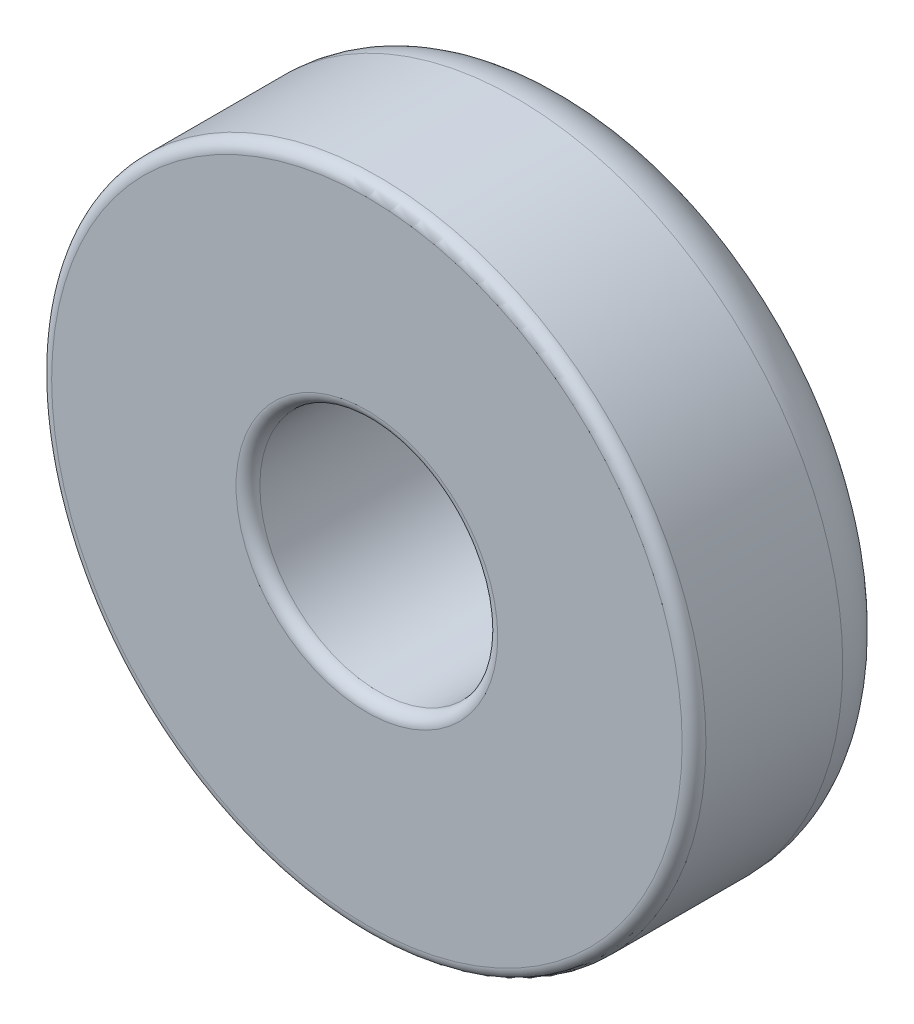
ISO-10303-21;
HEADER;
FILE_DESCRIPTION(('STEP AP214'),'2;1');
FILE_NAME('part.step','',(''),(''),'','','');
FILE_SCHEMA(('AUTOMOTIVE_DESIGN { 1 0 10303 214 1 1 1 1 }'));
ENDSEC;
DATA;
#1=APPLICATION_CONTEXT('core data for automotive mechanical design processes');
#2=APPLICATION_PROTOCOL_DEFINITION('international standard','automotive_design',2000,#1);
#3=PRODUCT_CONTEXT('',#1,'mechanical');
#4=PRODUCT('Part','Part','',(#3));
#5=PRODUCT_RELATED_PRODUCT_CATEGORY('part','',(#4));
#6=PRODUCT_DEFINITION_FORMATION('','',#4);
#7=PRODUCT_DEFINITION_CONTEXT('part definition',#1,'design');
#8=PRODUCT_DEFINITION('design','',#6,#7);
#9=PRODUCT_DEFINITION_SHAPE('','',#8);
#10=(LENGTH_UNIT() NAMED_UNIT(*) SI_UNIT(.MILLI.,.METRE.));
#11=(NAMED_UNIT(*) PLANE_ANGLE_UNIT() SI_UNIT($,.RADIAN.));
#12=(NAMED_UNIT(*) SI_UNIT($,.STERADIAN.) SOLID_ANGLE_UNIT());
#13=UNCERTAINTY_MEASURE_WITH_UNIT(LENGTH_MEASURE(1.E-05),#10,'distance_accuracy_value','');
#14=(GEOMETRIC_REPRESENTATION_CONTEXT(3) GLOBAL_UNCERTAINTY_ASSIGNED_CONTEXT((#13)) GLOBAL_UNIT_ASSIGNED_CONTEXT((#10,
#11,#12)) REPRESENTATION_CONTEXT('',''));
#15=CARTESIAN_POINT('',(0.,0.,0.));
#16=DIRECTION('',(0.,0.,1.));
#17=DIRECTION('',(1.,0.,0.));
#18=AXIS2_PLACEMENT_3D('',#15,#16,#17);
#19=CARTESIAN_POINT('',(0.,0.,1.75));
#20=DIRECTION('',(0.,0.,1.));
#21=DIRECTION('',(1.,0.,0.));
#22=AXIS2_PLACEMENT_3D('',#19,#20,#21);
#23=PLANE('',#22);
#24=CARTESIAN_POINT('',(0.,0.,1.75));
#25=DIRECTION('',(0.,0.,1.));
#26=DIRECTION('',(1.,0.,0.));
#27=AXIS2_PLACEMENT_3D('',#24,#25,#26);
#28=CIRCLE('',#27,1.1);
#29=CARTESIAN_POINT('',(1.1,0.,1.75));
#30=VERTEX_POINT('',#29);
#31=EDGE_CURVE('E52',#30,#30,#28,.F.);
#32=ORIENTED_EDGE('',*,*,#31,.T.);
#33=EDGE_LOOP('',(#32));
#34=FACE_BOUND('',#33,.T.);
#35=CARTESIAN_POINT('',(0.,0.,1.75));
#36=DIRECTION('',(0.,0.,1.));
#37=DIRECTION('',(1.,0.,0.));
#38=AXIS2_PLACEMENT_3D('',#35,#36,#37);
#39=CIRCLE('',#38,2.65);
#40=CARTESIAN_POINT('',(2.65,0.,1.75));
#41=VERTEX_POINT('',#40);
#42=EDGE_CURVE('E56',#41,#41,#39,.T.);
#43=ORIENTED_EDGE('',*,*,#42,.T.);
#44=EDGE_LOOP('',(#43));
#45=FACE_BOUND('',#44,.T.);
#46=ADVANCED_FACE('F45',(#34,#45),#23,.T.);
#47=CARTESIAN_POINT('',(0.,0.,0.));
#48=DIRECTION('',(0.,0.,1.));
#49=DIRECTION('',(1.,0.,0.));
#50=AXIS2_PLACEMENT_3D('',#47,#48,#49);
#51=PLANE('',#50);
#52=CARTESIAN_POINT('',(0.,0.,0.));
#53=DIRECTION('',(0.,0.,1.));
#54=DIRECTION('',(1.,0.,0.));
#55=AXIS2_PLACEMENT_3D('',#52,#53,#54);
#56=CIRCLE('',#55,1.1);
#57=CARTESIAN_POINT('',(1.1,0.,0.));
#58=VERTEX_POINT('',#57);
#59=EDGE_CURVE('E68',#58,#58,#56,.T.);
#60=ORIENTED_EDGE('',*,*,#59,.T.);
#61=EDGE_LOOP('',(#60));
#62=FACE_BOUND('',#61,.T.);
#63=CARTESIAN_POINT('',(0.,0.,0.));
#64=DIRECTION('',(0.,0.,1.));
#65=DIRECTION('',(1.,0.,0.));
#66=AXIS2_PLACEMENT_3D('',#63,#64,#65);
#67=CIRCLE('',#66,2.25);
#68=CARTESIAN_POINT('',(2.25,0.,0.));
#69=VERTEX_POINT('',#68);
#70=EDGE_CURVE('E71',#69,#69,#67,.F.);
#71=ORIENTED_EDGE('',*,*,#70,.T.);
#72=EDGE_LOOP('',(#71));
#73=FACE_BOUND('',#72,.T.);
#74=ADVANCED_FACE('F98',(#62,#73),#51,.F.);
#75=CARTESIAN_POINT('',(0.,0.,1.75));
#76=DIRECTION('',(0.,0.,-1.));
#77=DIRECTION('',(-1.,0.,0.));
#78=AXIS2_PLACEMENT_3D('',#75,#76,#77);
#79=CYLINDRICAL_SURFACE('',#78,2.75);
#80=CARTESIAN_POINT('',(0.,0.,1.65));
#81=DIRECTION('',(0.,0.,1.));
#82=DIRECTION('',(1.,0.,0.));
#83=AXIS2_PLACEMENT_3D('',#80,#81,#82);
#84=CIRCLE('',#83,2.75);
#85=CARTESIAN_POINT('',(2.75,0.,1.65));
#86=VERTEX_POINT('',#85);
#87=EDGE_CURVE('E11',#86,#86,#84,.F.);
#88=ORIENTED_EDGE('',*,*,#87,.T.);
#89=EDGE_LOOP('',(#88));
#90=FACE_BOUND('',#89,.T.);
#91=CARTESIAN_POINT('',(0.,0.,0.5));
#92=DIRECTION('',(0.,0.,1.));
#93=DIRECTION('',(1.,0.,0.));
#94=AXIS2_PLACEMENT_3D('',#91,#92,#93);
#95=CIRCLE('',#94,2.75);
#96=CARTESIAN_POINT('',(2.75,0.,0.5));
#97=VERTEX_POINT('',#96);
#98=EDGE_CURVE('E74',#97,#97,#95,.T.);
#99=ORIENTED_EDGE('',*,*,#98,.T.);
#100=EDGE_LOOP('',(#99));
#101=FACE_BOUND('',#100,.T.);
#102=ADVANCED_FACE('F78',(#90,#101),#79,.T.);
#103=CARTESIAN_POINT('',(0.,0.,1.75));
#104=DIRECTION('',(0.,0.,-1.));
#105=DIRECTION('',(-1.,0.,0.));
#106=AXIS2_PLACEMENT_3D('',#103,#104,#105);
#107=CYLINDRICAL_SURFACE('',#106,1.);
#108=CARTESIAN_POINT('',(0.,0.,0.1));
#109=DIRECTION('',(0.,0.,1.));
#110=DIRECTION('',(1.,0.,0.));
#111=AXIS2_PLACEMENT_3D('',#108,#109,#110);
#112=CIRCLE('',#111,1.);
#113=CARTESIAN_POINT('',(1.,0.,0.1));
#114=VERTEX_POINT('',#113);
#115=EDGE_CURVE('E60',#114,#114,#112,.F.);
#116=ORIENTED_EDGE('',*,*,#115,.T.);
#117=EDGE_LOOP('',(#116));
#118=FACE_BOUND('',#117,.T.);
#119=CARTESIAN_POINT('',(0.,0.,1.65));
#120=DIRECTION('',(0.,0.,1.));
#121=DIRECTION('',(1.,0.,0.));
#122=AXIS2_PLACEMENT_3D('',#119,#120,#121);
#123=CIRCLE('',#122,1.);
#124=CARTESIAN_POINT('',(1.,0.,1.65));
#125=VERTEX_POINT('',#124);
#126=EDGE_CURVE('E65',#125,#125,#123,.T.);
#127=ORIENTED_EDGE('',*,*,#126,.T.);
#128=EDGE_LOOP('',(#127));
#129=FACE_BOUND('',#128,.T.);
#130=ADVANCED_FACE('F83',(#118,#129),#107,.F.);
#131=CARTESIAN_POINT('',(0.,0.,0.5));
#132=DIRECTION('',(0.,0.,1.));
#133=DIRECTION('',(1.,0.,0.));
#134=AXIS2_PLACEMENT_3D('',#131,#132,#133);
#135=TOROIDAL_SURFACE('',#134,2.25,0.5);
#136=ORIENTED_EDGE('',*,*,#70,.F.);
#137=EDGE_LOOP('',(#136));
#138=FACE_BOUND('',#137,.T.);
#139=ORIENTED_EDGE('',*,*,#98,.F.);
#140=EDGE_LOOP('',(#139));
#141=FACE_BOUND('',#140,.T.);
#142=ADVANCED_FACE('F80',(#138,#141),#135,.T.);
#143=CARTESIAN_POINT('',(0.,0.,0.1));
#144=DIRECTION('',(0.,0.,1.));
#145=DIRECTION('',(1.,0.,0.));
#146=AXIS2_PLACEMENT_3D('',#143,#144,#145);
#147=TOROIDAL_SURFACE('',#146,1.1,0.1);
#148=ORIENTED_EDGE('',*,*,#115,.F.);
#149=EDGE_LOOP('',(#148));
#150=FACE_BOUND('',#149,.T.);
#151=ORIENTED_EDGE('',*,*,#59,.F.);
#152=EDGE_LOOP('',(#151));
#153=FACE_BOUND('',#152,.T.);
#154=ADVANCED_FACE('F82',(#150,#153),#147,.T.);
#155=CARTESIAN_POINT('',(0.,0.,1.65));
#156=DIRECTION('',(0.,0.,1.));
#157=DIRECTION('',(1.,0.,0.));
#158=AXIS2_PLACEMENT_3D('',#155,#156,#157);
#159=TOROIDAL_SURFACE('',#158,1.1,0.1);
#160=ORIENTED_EDGE('',*,*,#31,.F.);
#161=EDGE_LOOP('',(#160));
#162=FACE_BOUND('',#161,.T.);
#163=ORIENTED_EDGE('',*,*,#126,.F.);
#164=EDGE_LOOP('',(#163));
#165=FACE_BOUND('',#164,.T.);
#166=ADVANCED_FACE('F90',(#162,#165),#159,.T.);
#167=CARTESIAN_POINT('',(0.,0.,1.65));
#168=DIRECTION('',(0.,0.,1.));
#169=DIRECTION('',(1.,0.,0.));
#170=AXIS2_PLACEMENT_3D('',#167,#168,#169);
#171=TOROIDAL_SURFACE('',#170,2.65,0.1);
#172=ORIENTED_EDGE('',*,*,#87,.F.);
#173=EDGE_LOOP('',(#172));
#174=FACE_BOUND('',#173,.T.);
#175=ORIENTED_EDGE('',*,*,#42,.F.);
#176=EDGE_LOOP('',(#175));
#177=FACE_BOUND('',#176,.T.);
#178=ADVANCED_FACE('F47',(#174,#177),#171,.T.);
#179=CLOSED_SHELL('',(#46,#74,#102,#130,#142,#154,#166,#178));
#180=MANIFOLD_SOLID_BREP('B2',#179);
#181=ADVANCED_BREP_SHAPE_REPRESENTATION('',(#18,#180),#14);
#182=SHAPE_DEFINITION_REPRESENTATION(#9,#181);
ENDSEC;
END-ISO-10303-21;
